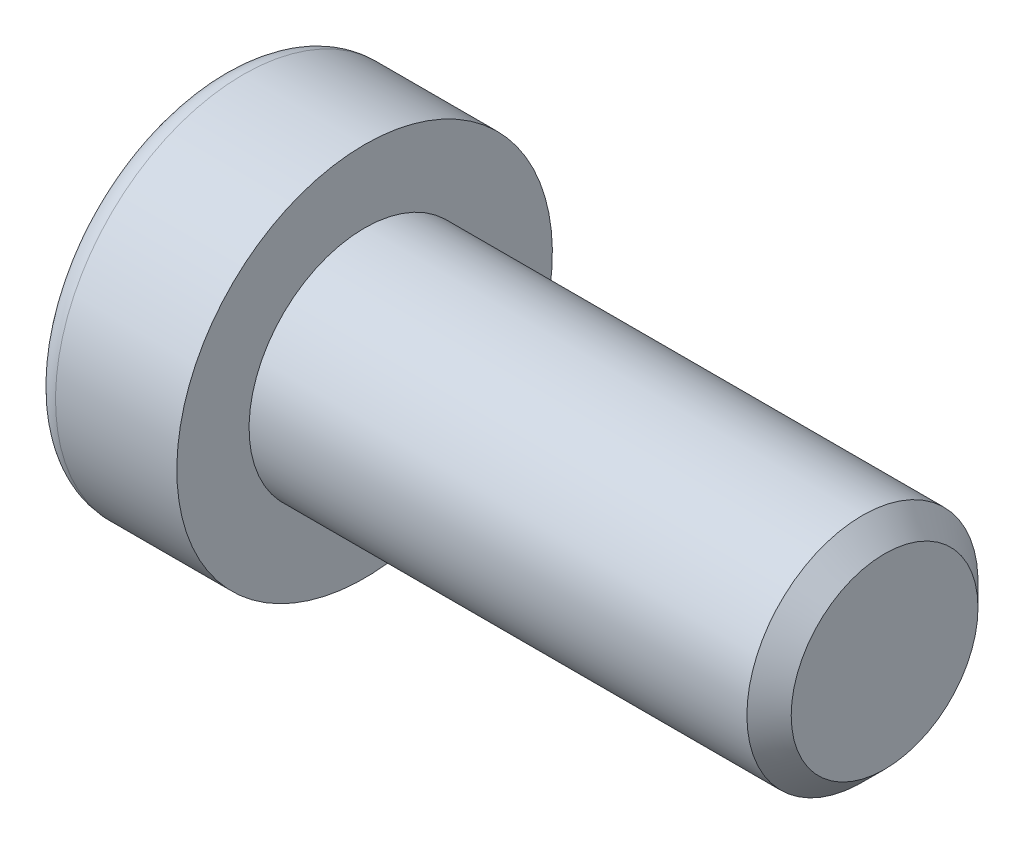
ISO-10303-21;
HEADER;
FILE_DESCRIPTION(('STEP AP214'),'2;1');
FILE_NAME('part.step','',(''),(''),'','','');
FILE_SCHEMA(('AUTOMOTIVE_DESIGN { 1 0 10303 214 1 1 1 1 }'));
ENDSEC;
DATA;
#1=APPLICATION_CONTEXT('core data for automotive mechanical design processes');
#2=APPLICATION_PROTOCOL_DEFINITION('international standard','automotive_design',2000,#1);
#3=PRODUCT_CONTEXT('',#1,'mechanical');
#4=PRODUCT('Part','Part','',(#3));
#5=PRODUCT_RELATED_PRODUCT_CATEGORY('part','',(#4));
#6=PRODUCT_DEFINITION_FORMATION('','',#4);
#7=PRODUCT_DEFINITION_CONTEXT('part definition',#1,'design');
#8=PRODUCT_DEFINITION('design','',#6,#7);
#9=PRODUCT_DEFINITION_SHAPE('','',#8);
#10=(LENGTH_UNIT() NAMED_UNIT(*) SI_UNIT(.MILLI.,.METRE.));
#11=(NAMED_UNIT(*) PLANE_ANGLE_UNIT() SI_UNIT($,.RADIAN.));
#12=(NAMED_UNIT(*) SI_UNIT($,.STERADIAN.) SOLID_ANGLE_UNIT());
#13=UNCERTAINTY_MEASURE_WITH_UNIT(LENGTH_MEASURE(1.E-05),#10,'distance_accuracy_value','');
#14=(GEOMETRIC_REPRESENTATION_CONTEXT(3) GLOBAL_UNCERTAINTY_ASSIGNED_CONTEXT((#13)) GLOBAL_UNIT_ASSIGNED_CONTEXT((#10,
#11,#12)) REPRESENTATION_CONTEXT('',''));
#15=CARTESIAN_POINT('',(0.,0.,0.));
#16=DIRECTION('',(0.,0.,1.));
#17=DIRECTION('',(1.,0.,0.));
#18=AXIS2_PLACEMENT_3D('',#15,#16,#17);
#19=CARTESIAN_POINT('',(-1.21000000177673,0.,0.));
#20=DIRECTION('',(-1.,0.,0.));
#21=DIRECTION('',(0.,0.,1.));
#22=AXIS2_PLACEMENT_3D('',#19,#20,#21);
#23=CONICAL_SURFACE('',#22,2.9040718530382,1.04719754996794);
#24=CARTESIAN_POINT('',(0.466666669012739,-1.13686837721616E-10,0.));
#25=VERTEX_POINT('',#24);
#26=VERTEX_LOOP('',#25);
#27=FACE_BOUND('',#26,.T.);
#28=CARTESIAN_POINT('',(-1.20000000188032,2.50000000042828,1.44337567243126));
#29=CARTESIAN_POINT('',(-1.16336943336427,2.50000000015382,1.31652043353318));
#30=CARTESIAN_POINT('',(-1.13005584831707,2.50000000004123,1.18857018203745));
#31=CARTESIAN_POINT('',(-1.07190798610144,2.49999999995868,0.930454306037677));
#32=CARTESIAN_POINT('',(-1.04709427719735,2.49999999998906,0.800284096806924));
#33=CARTESIAN_POINT('',(-1.00846995036617,2.50000000001067,0.541556812494233));
#34=CARTESIAN_POINT('',(-0.994402236162447,2.50000000000284,0.413039534770439));
#35=CARTESIAN_POINT('',(-0.977611461824864,2.49999999999716,0.155400578562858));
#36=CARTESIAN_POINT('',(-0.974874494142074,2.49999999999929,0.02627983588409));
#37=CARTESIAN_POINT('',(-0.980582864422355,2.50000000000062,-0.21496841995549));
#38=CARTESIAN_POINT('',(-0.987626608278002,2.50000000000017,-0.327132134383147));
#39=CARTESIAN_POINT('',(-1.00994662771906,2.49999999999983,-0.550728853222557));
#40=CARTESIAN_POINT('',(-1.02523052031715,2.49999999999995,-0.66216108485018));
#41=CARTESIAN_POINT('',(-1.06343729360609,2.50000000000005,-0.886218434015897));
#42=CARTESIAN_POINT('',(-1.08652205474861,2.50000000000003,-0.998815208377871));
#43=CARTESIAN_POINT('',(-1.13891470311393,2.49999999999998,-1.2223298619213));
#44=CARTESIAN_POINT('',(-1.16821028805135,2.49999999999995,-1.33325060237494));
#45=CARTESIAN_POINT('',(-1.20000000215881,2.5,-1.44337567242466));
#46=B_SPLINE_CURVE_WITH_KNOTS('',3,(#28,#29,#30,#31,#32,#33,#34,#35,#36,#37,#38,#39,#40,#41,#42,
#43,#44,#45),.UNSPECIFIED.,.F.,.F.,(4,2,2,2,2,2,2,2,4),(0.,0.396270014515872,0.793492271437725,
1.18088450788727,1.56780111135406,1.90463472821334,2.24178024186127,2.58640202744164,
2.93034746593166),.UNSPECIFIED.);
#47=CARTESIAN_POINT('',(-1.20000000213914,2.49999999973261,1.44337567281968));
#48=VERTEX_POINT('',#47);
#49=CARTESIAN_POINT('',(-1.20000000222827,2.5,-1.44337567266531));
#50=VERTEX_POINT('',#49);
#51=EDGE_CURVE('E19',#48,#50,#46,.T.);
#52=ORIENTED_EDGE('',*,*,#51,.T.);
#53=CARTESIAN_POINT('',(-1.20000000188032,2.49999999974406,-1.44337567361636));
#54=CARTESIAN_POINT('',(-1.16336943336427,2.39014014011794,-1.50680329282772));
#55=CARTESIAN_POINT('',(-1.13005584831707,2.27933197184574,-1.57077841847808));
#56=CARTESIAN_POINT('',(-1.07190798610144,2.05579706606859,-1.69983635640647));
#57=CARTESIAN_POINT('',(-1.04709427719735,1.94306635807401,-1.76492146104816));
#58=CARTESIAN_POINT('',(-1.00846995036617,1.71900195721787,-1.89428510322322));
#59=CARTESIAN_POINT('',(-0.994402236162447,1.60770272987993,-1.95854374207834));
#60=CARTESIAN_POINT('',(-0.977611461824864,1.38458084879682,-2.08736322017721));
#61=CARTESIAN_POINT('',(-0.974874494142074,1.27275900548255,-2.15192359151843));
#62=CARTESIAN_POINT('',(-0.980582864422354,1.06383188730746,-2.27254771943938));
#63=CARTESIAN_POINT('',(-0.987626608278001,0.966695261230055,-2.32862957665281));
#64=CARTESIAN_POINT('',(-1.00994662771905,0.773054822512112,-2.44042793607223));
#65=CARTESIAN_POINT('',(-1.02523052031715,0.676551679122258,-2.49614405188614));
#66=CARTESIAN_POINT('',(-1.06343729360609,0.482512322840196,-2.60817272646909));
#67=CARTESIAN_POINT('',(-1.08652205474861,0.385000655858529,-2.66447111365005));
#68=CARTESIAN_POINT('',(-1.13891470311393,0.191431287771819,-2.77622844042172));
#69=CARTESIAN_POINT('',(-1.16821028805135,0.09537110873237,-2.83168881064853));
#70=CARTESIAN_POINT('',(-1.20000000215881,4.75795596297873E-10,-2.88675134567343));
#71=B_SPLINE_CURVE_WITH_KNOTS('',3,(#53,#54,#55,#56,#57,#58,#59,#60,#61,#62,#63,#64,#65,#66,#67,
#68,#69,#70),.UNSPECIFIED.,.F.,.F.,(4,2,2,2,2,2,2,2,4),(0.,0.396270014515871,0.793492271437724,
1.18088450788727,1.56780111135406,1.90463472821334,2.24178024186127,2.58640202744164,
2.93034746593166),.UNSPECIFIED.);
#72=CARTESIAN_POINT('',(-1.20000000213914,0.,-2.88675134563937));
#73=VERTEX_POINT('',#72);
#74=EDGE_CURVE('E79',#50,#73,#71,.T.);
#75=ORIENTED_EDGE('',*,*,#74,.T.);
#76=CARTESIAN_POINT('',(-1.20000000188032,-6.84219601947254E-10,-2.88675134604762));
#77=CARTESIAN_POINT('',(-1.16336943336427,-0.109859860035873,-2.8233237263609));
#78=CARTESIAN_POINT('',(-1.13005584831707,-0.220668028195489,-2.75934860051552));
#79=CARTESIAN_POINT('',(-1.07190798610144,-0.444202933890087,-2.63029066244415));
#80=CARTESIAN_POINT('',(-1.04709427719735,-0.556933641915047,-2.56520555785509));
#81=CARTESIAN_POINT('',(-1.00846995036617,-0.780998042792801,-2.43584191571745));
#82=CARTESIAN_POINT('',(-0.994402236162447,-0.892297270122914,-2.37158327684878));
#83=CARTESIAN_POINT('',(-0.977611461824864,-1.11541915120034,-2.24276379874007));
#84=CARTESIAN_POINT('',(-0.974874494142074,-1.22724099451673,-2.17820342740253));
#85=CARTESIAN_POINT('',(-0.980582864422354,-1.43616811269316,-2.05757929948389));
#86=CARTESIAN_POINT('',(-0.987626608278001,-1.53330473877011,-2.00149744226967));
#87=CARTESIAN_POINT('',(-1.00994662771906,-1.72694517748772,-1.88969908284967));
#88=CARTESIAN_POINT('',(-1.02523052031715,-1.82344832087769,-1.83398296703597));
#89=CARTESIAN_POINT('',(-1.06343729360609,-2.01748767715985,-1.72195429245319));
#90=CARTESIAN_POINT('',(-1.08652205474861,-2.1149993441415,-1.66565590527218));
#91=CARTESIAN_POINT('',(-1.13891470311393,-2.30856871222816,-1.55389857850043));
#92=CARTESIAN_POINT('',(-1.16821028805135,-2.40462889126758,-1.49843820827358));
#93=CARTESIAN_POINT('',(-1.20000000215881,-2.49999999952421,-1.44337567324877));
#94=B_SPLINE_CURVE_WITH_KNOTS('',3,(#76,#77,#78,#79,#80,#81,#82,#83,#84,#85,#86,#87,#88,#89,#90,
#91,#92,#93),.UNSPECIFIED.,.F.,.F.,(4,2,2,2,2,2,2,2,4),(0.,0.396270014515872,0.793492271437725,
1.18088450788727,1.56780111135406,1.90463472821334,2.24178024186127,2.58640202744164,
2.93034746593167),.UNSPECIFIED.);
#95=CARTESIAN_POINT('',(-1.20000000213914,-2.49999999973261,-1.44337567281968));
#96=VERTEX_POINT('',#95);
#97=EDGE_CURVE('E104',#73,#96,#94,.T.);
#98=ORIENTED_EDGE('',*,*,#97,.T.);
#99=CARTESIAN_POINT('',(-1.20000000188032,-2.50000000042828,-1.44337567243126));
#100=CARTESIAN_POINT('',(-1.16336943336427,-2.50000000015382,-1.31652043353318));
#101=CARTESIAN_POINT('',(-1.13005584831707,-2.50000000004123,-1.18857018203745));
#102=CARTESIAN_POINT('',(-1.07190798610144,-2.49999999995868,-0.93045430603768));
#103=CARTESIAN_POINT('',(-1.04709427719735,-2.49999999998906,-0.800284096806928));
#104=CARTESIAN_POINT('',(-1.00846995036617,-2.50000000001067,-0.541556812494236));
#105=CARTESIAN_POINT('',(-0.994402236162447,-2.50000000000284,-0.413039534770443));
#106=CARTESIAN_POINT('',(-0.977611461824863,-2.49999999999716,-0.155400578562862));
#107=CARTESIAN_POINT('',(-0.974874494142073,-2.49999999999929,-0.0262798358840941));
#108=CARTESIAN_POINT('',(-0.980582864422354,-2.50000000000062,0.214968419955486));
#109=CARTESIAN_POINT('',(-0.987626608278001,-2.50000000000017,0.327132134383144));
#110=CARTESIAN_POINT('',(-1.00994662771905,-2.49999999999983,0.550728853222554));
#111=CARTESIAN_POINT('',(-1.02523052031715,-2.49999999999995,0.662161084850177));
#112=CARTESIAN_POINT('',(-1.06343729360609,-2.50000000000005,0.886218434015895));
#113=CARTESIAN_POINT('',(-1.08652205474861,-2.50000000000002,0.99881520837787));
#114=CARTESIAN_POINT('',(-1.13891470311393,-2.49999999999998,1.2223298619213));
#115=CARTESIAN_POINT('',(-1.16821028805135,-2.49999999999995,1.33325060237494));
#116=CARTESIAN_POINT('',(-1.20000000215881,-2.5,1.44337567242466));
#117=B_SPLINE_CURVE_WITH_KNOTS('',3,(#99,#100,#101,#102,#103,#104,#105,#106,#107,#108,#109,#110,
#111,#112,#113,#114,#115,#116),.UNSPECIFIED.,.F.,.F.,(4,2,2,2,2,2,2,2,4),(0.,0.396270014515872,
0.793492271437724,1.18088450788727,1.56780111135406,1.90463472821334,2.24178024186127,
2.58640202744164,2.93034746593167),.UNSPECIFIED.);
#118=CARTESIAN_POINT('',(-1.20000000213914,-2.49999999973261,1.44337567281969));
#119=VERTEX_POINT('',#118);
#120=EDGE_CURVE('E128',#96,#119,#117,.T.);
#121=ORIENTED_EDGE('',*,*,#120,.T.);
#122=CARTESIAN_POINT('',(-1.20000000188032,-2.49999999974406,1.44337567361636));
#123=CARTESIAN_POINT('',(-1.16336943336427,-2.39014014011795,1.50680329282772));
#124=CARTESIAN_POINT('',(-1.13005584831707,-2.27933197184574,1.57077841847808));
#125=CARTESIAN_POINT('',(-1.07190798610144,-2.05579706606859,1.69983635640647));
#126=CARTESIAN_POINT('',(-1.04709427719735,-1.94306635807401,1.76492146104816));
#127=CARTESIAN_POINT('',(-1.00846995036617,-1.71900195721787,1.89428510322322));
#128=CARTESIAN_POINT('',(-0.994402236162447,-1.60770272987993,1.95854374207834));
#129=CARTESIAN_POINT('',(-0.977611461824864,-1.38458084879682,2.08736322017721));
#130=CARTESIAN_POINT('',(-0.974874494142074,-1.27275900548255,2.15192359151843));
#131=CARTESIAN_POINT('',(-0.980582864422354,-1.06383188730746,2.27254771943938));
#132=CARTESIAN_POINT('',(-0.987626608278001,-0.966695261230056,2.32862957665281));
#133=CARTESIAN_POINT('',(-1.00994662771905,-0.773054822512113,2.44042793607223));
#134=CARTESIAN_POINT('',(-1.02523052031715,-0.676551679122259,2.49614405188614));
#135=CARTESIAN_POINT('',(-1.06343729360609,-0.482512322840196,2.60817272646909));
#136=CARTESIAN_POINT('',(-1.08652205474861,-0.385000655858529,2.66447111365005));
#137=CARTESIAN_POINT('',(-1.13891470311393,-0.19143128777182,2.77622844042172));
#138=CARTESIAN_POINT('',(-1.16821028805135,-0.0953711087323701,2.83168881064853));
#139=CARTESIAN_POINT('',(-1.20000000215881,-4.7579556411033E-10,2.88675134567343));
#140=B_SPLINE_CURVE_WITH_KNOTS('',3,(#122,#123,#124,#125,#126,#127,#128,#129,#130,#131,#132,
#133,#134,#135,#136,#137,#138,#139),.UNSPECIFIED.,.F.,.F.,(4,2,2,2,2,2,2,2,4),(0.,
0.396270014515872,0.793492271437725,1.18088450788727,1.56780111135406,1.90463472821334,
2.24178024186127,2.58640202744164,2.93034746593167),.UNSPECIFIED.);
#141=CARTESIAN_POINT('',(-1.20000000213914,0.,2.88675134563937));
#142=VERTEX_POINT('',#141);
#143=EDGE_CURVE('E136',#119,#142,#140,.T.);
#144=ORIENTED_EDGE('',*,*,#143,.T.);
#145=CARTESIAN_POINT('',(-1.20000000188032,6.84218409592331E-10,2.88675134604763));
#146=CARTESIAN_POINT('',(-1.16336943336427,0.109859860035872,2.8233237263609));
#147=CARTESIAN_POINT('',(-1.13005584831707,0.220668028195487,2.75934860051552));
#148=CARTESIAN_POINT('',(-1.07190798610144,0.444202933890086,2.63029066244415));
#149=CARTESIAN_POINT('',(-1.04709427719735,0.556933641915045,2.56520555785509));
#150=CARTESIAN_POINT('',(-1.00846995036617,0.780998042792799,2.43584191571745));
#151=CARTESIAN_POINT('',(-0.994402236162446,0.892297270122912,2.37158327684878));
#152=CARTESIAN_POINT('',(-0.977611461824863,1.11541915120034,2.24276379874007));
#153=CARTESIAN_POINT('',(-0.974874494142073,1.22724099451673,2.17820342740253));
#154=CARTESIAN_POINT('',(-0.980582864422353,1.43616811269316,2.05757929948389));
#155=CARTESIAN_POINT('',(-0.987626608278,1.53330473877011,2.00149744226967));
#156=CARTESIAN_POINT('',(-1.00994662771905,1.72694517748772,1.88969908284967));
#157=CARTESIAN_POINT('',(-1.02523052031715,1.82344832087769,1.83398296703596));
#158=CARTESIAN_POINT('',(-1.06343729360609,2.01748767715985,1.72195429245319));
#159=CARTESIAN_POINT('',(-1.08652205474861,2.1149993441415,1.66565590527218));
#160=CARTESIAN_POINT('',(-1.13891470311393,2.30856871222816,1.55389857850042));
#161=CARTESIAN_POINT('',(-1.16821028805135,2.40462889126758,1.49843820827358));
#162=CARTESIAN_POINT('',(-1.2000000021588,2.49999999952421,1.44337567324876));
#163=B_SPLINE_CURVE_WITH_KNOTS('',3,(#145,#146,#147,#148,#149,#150,#151,#152,#153,#154,#155,
#156,#157,#158,#159,#160,#161,#162),.UNSPECIFIED.,.F.,.F.,(4,2,2,2,2,2,2,2,4),(0.,
0.396270014515872,0.793492271437725,1.18088450788727,1.56780111135406,1.90463472821334,
2.24178024186127,2.58640202744164,2.93034746593167),.UNSPECIFIED.);
#164=EDGE_CURVE('E81',#142,#48,#163,.T.);
#165=ORIENTED_EDGE('',*,*,#164,.T.);
#166=EDGE_LOOP('',(#52,#75,#98,#121,#144,#165));
#167=FACE_BOUND('',#166,.T.);
#168=ADVANCED_FACE('F15',(#27,#167),#23,.F.);
#169=CARTESIAN_POINT('',(-5.,2.5,1.44337567297406));
#170=DIRECTION('',(0.,1.,0.));
#171=DIRECTION('',(0.,0.,1.));
#172=AXIS2_PLACEMENT_3D('',#169,#170,#171);
#173=PLANE('',#172);
#174=DIRECTION('',(1.,0.,0.));
#175=VECTOR('',#174,1.);
#176=CARTESIAN_POINT('',(-5.,2.5,1.44337567297406));
#177=LINE('',#176,#175);
#178=CARTESIAN_POINT('',(-5.,2.5,1.44337567297406));
#179=VERTEX_POINT('',#178);
#180=EDGE_CURVE('E83',#48,#179,#177,.F.);
#181=ORIENTED_EDGE('',*,*,#180,.T.);
#182=DIRECTION('',(0.,0.,1.));
#183=VECTOR('',#182,1.);
#184=CARTESIAN_POINT('',(-5.,2.5,0.));
#185=LINE('',#184,#183);
#186=CARTESIAN_POINT('',(-5.,2.5,-1.44337567297407));
#187=VERTEX_POINT('',#186);
#188=EDGE_CURVE('E88',#187,#179,#185,.T.);
#189=ORIENTED_EDGE('',*,*,#188,.F.);
#190=DIRECTION('',(1.,0.,0.));
#191=VECTOR('',#190,1.);
#192=CARTESIAN_POINT('',(-5.,2.5,-1.44337567297407));
#193=LINE('',#192,#191);
#194=EDGE_CURVE('E86',#187,#50,#193,.T.);
#195=ORIENTED_EDGE('',*,*,#194,.T.);
#196=ORIENTED_EDGE('',*,*,#51,.F.);
#197=EDGE_LOOP('',(#181,#189,#195,#196));
#198=FACE_BOUND('',#197,.T.);
#199=ADVANCED_FACE('F75',(#198),#173,.F.);
#200=CARTESIAN_POINT('',(-5.,0.,2.88675134594813));
#201=DIRECTION('',(0.,0.500000000000001,0.866025403784438));
#202=DIRECTION('',(0.,-0.866025403784438,0.500000000000001));
#203=AXIS2_PLACEMENT_3D('',#200,#201,#202);
#204=PLANE('',#203);
#205=DIRECTION('',(1.,0.,0.));
#206=VECTOR('',#205,1.);
#207=CARTESIAN_POINT('',(-5.,0.,2.88675134594813));
#208=LINE('',#207,#206);
#209=CARTESIAN_POINT('',(-5.,0.,2.88675134594813));
#210=VERTEX_POINT('',#209);
#211=EDGE_CURVE('E140',#142,#210,#208,.F.);
#212=ORIENTED_EDGE('',*,*,#211,.T.);
#213=DIRECTION('',(0.,-0.866025403784438,0.500000000000001));
#214=VECTOR('',#213,1.);
#215=CARTESIAN_POINT('',(-5.,2.5,1.44337567297406));
#216=LINE('',#215,#214);
#217=EDGE_CURVE('E94',#179,#210,#216,.T.);
#218=ORIENTED_EDGE('',*,*,#217,.F.);
#219=ORIENTED_EDGE('',*,*,#180,.F.);
#220=ORIENTED_EDGE('',*,*,#164,.F.);
#221=EDGE_LOOP('',(#212,#218,#219,#220));
#222=FACE_BOUND('',#221,.T.);
#223=ADVANCED_FACE('F144',(#222),#204,.F.);
#224=CARTESIAN_POINT('',(-5.,-2.5,1.44337567297406));
#225=DIRECTION('',(0.,-0.5,0.866025403784439));
#226=DIRECTION('',(0.,-0.866025403784439,-0.5));
#227=AXIS2_PLACEMENT_3D('',#224,#225,#226);
#228=PLANE('',#227);
#229=DIRECTION('',(1.,0.,0.));
#230=VECTOR('',#229,1.);
#231=CARTESIAN_POINT('',(-5.,-2.5,1.44337567297406));
#232=LINE('',#231,#230);
#233=CARTESIAN_POINT('',(-5.,-2.5,1.44337567297406));
#234=VERTEX_POINT('',#233);
#235=EDGE_CURVE('E135',#119,#234,#232,.F.);
#236=ORIENTED_EDGE('',*,*,#235,.T.);
#237=DIRECTION('',(0.,-0.866025403784439,-0.5));
#238=VECTOR('',#237,1.);
#239=CARTESIAN_POINT('',(-5.,0.,2.88675134594813));
#240=LINE('',#239,#238);
#241=EDGE_CURVE('E222',#210,#234,#240,.T.);
#242=ORIENTED_EDGE('',*,*,#241,.F.);
#243=ORIENTED_EDGE('',*,*,#211,.F.);
#244=ORIENTED_EDGE('',*,*,#143,.F.);
#245=EDGE_LOOP('',(#236,#242,#243,#244));
#246=FACE_BOUND('',#245,.T.);
#247=ADVANCED_FACE('F124',(#246),#228,.F.);
#248=CARTESIAN_POINT('',(-5.,-2.5,-1.44337567297406));
#249=DIRECTION('',(0.,-1.,0.));
#250=DIRECTION('',(0.,0.,-1.));
#251=AXIS2_PLACEMENT_3D('',#248,#249,#250);
#252=PLANE('',#251);
#253=DIRECTION('',(1.,0.,0.));
#254=VECTOR('',#253,1.);
#255=CARTESIAN_POINT('',(-5.,-2.5,-1.44337567297406));
#256=LINE('',#255,#254);
#257=CARTESIAN_POINT('',(-5.,-2.5,-1.44337567297406));
#258=VERTEX_POINT('',#257);
#259=EDGE_CURVE('E134',#96,#258,#256,.F.);
#260=ORIENTED_EDGE('',*,*,#259,.T.);
#261=DIRECTION('',(0.,0.,1.));
#262=VECTOR('',#261,1.);
#263=CARTESIAN_POINT('',(-5.,-2.5,0.));
#264=LINE('',#263,#262);
#265=EDGE_CURVE('E219',#234,#258,#264,.F.);
#266=ORIENTED_EDGE('',*,*,#265,.F.);
#267=ORIENTED_EDGE('',*,*,#235,.F.);
#268=ORIENTED_EDGE('',*,*,#120,.F.);
#269=EDGE_LOOP('',(#260,#266,#267,#268));
#270=FACE_BOUND('',#269,.T.);
#271=ADVANCED_FACE('F120',(#270),#252,.F.);
#272=CARTESIAN_POINT('',(-5.,0.,-2.88675134594813));
#273=DIRECTION('',(0.,-0.5,-0.866025403784439));
#274=DIRECTION('',(0.,0.866025403784439,-0.5));
#275=AXIS2_PLACEMENT_3D('',#272,#273,#274);
#276=PLANE('',#275);
#277=DIRECTION('',(1.,0.,0.));
#278=VECTOR('',#277,1.);
#279=CARTESIAN_POINT('',(-5.,0.,-2.88675134594813));
#280=LINE('',#279,#278);
#281=CARTESIAN_POINT('',(-5.,0.,-2.88675134594813));
#282=VERTEX_POINT('',#281);
#283=EDGE_CURVE('E37',#73,#282,#280,.F.);
#284=ORIENTED_EDGE('',*,*,#283,.T.);
#285=DIRECTION('',(0.,0.866025403784438,-0.500000000000001));
#286=VECTOR('',#285,1.);
#287=CARTESIAN_POINT('',(-5.,-2.5,-1.44337567297406));
#288=LINE('',#287,#286);
#289=EDGE_CURVE('E216',#258,#282,#288,.T.);
#290=ORIENTED_EDGE('',*,*,#289,.F.);
#291=ORIENTED_EDGE('',*,*,#259,.F.);
#292=ORIENTED_EDGE('',*,*,#97,.F.);
#293=EDGE_LOOP('',(#284,#290,#291,#292));
#294=FACE_BOUND('',#293,.T.);
#295=ADVANCED_FACE('F114',(#294),#276,.F.);
#296=CARTESIAN_POINT('',(-5.,2.5,-1.44337567297407));
#297=DIRECTION('',(0.,0.5,-0.866025403784439));
#298=DIRECTION('',(0.,0.866025403784439,0.5));
#299=AXIS2_PLACEMENT_3D('',#296,#297,#298);
#300=PLANE('',#299);
#301=ORIENTED_EDGE('',*,*,#194,.F.);
#302=DIRECTION('',(0.,0.866025403784439,0.5));
#303=VECTOR('',#302,1.);
#304=CARTESIAN_POINT('',(-5.,0.,-2.88675134594813));
#305=LINE('',#304,#303);
#306=EDGE_CURVE('E214',#282,#187,#305,.T.);
#307=ORIENTED_EDGE('',*,*,#306,.F.);
#308=ORIENTED_EDGE('',*,*,#283,.F.);
#309=ORIENTED_EDGE('',*,*,#74,.F.);
#310=EDGE_LOOP('',(#301,#307,#308,#309));
#311=FACE_BOUND('',#310,.T.);
#312=ADVANCED_FACE('F92',(#311),#300,.F.);
#313=CARTESIAN_POINT('',(-5.,4.69337567297407,0.));
#314=DIRECTION('',(-1.,0.,0.));
#315=DIRECTION('',(0.,0.,1.));
#316=AXIS2_PLACEMENT_3D('',#313,#314,#315);
#317=PLANE('',#316);
#318=ORIENTED_EDGE('',*,*,#289,.T.);
#319=ORIENTED_EDGE('',*,*,#306,.T.);
#320=ORIENTED_EDGE('',*,*,#188,.T.);
#321=ORIENTED_EDGE('',*,*,#217,.T.);
#322=ORIENTED_EDGE('',*,*,#241,.T.);
#323=ORIENTED_EDGE('',*,*,#265,.T.);
#324=EDGE_LOOP('',(#318,#319,#320,#321,#322,#323));
#325=FACE_BOUND('',#324,.T.);
#326=CARTESIAN_POINT('',(-5.,0.,0.));
#327=DIRECTION('',(1.,0.,0.));
#328=DIRECTION('',(0.,1.,0.));
#329=AXIS2_PLACEMENT_3D('',#326,#327,#328);
#330=CIRCLE('',#329,5.7);
#331=CARTESIAN_POINT('',(-5.,5.7,0.));
#332=VERTEX_POINT('',#331);
#333=EDGE_CURVE('E191',#332,#332,#330,.T.);
#334=ORIENTED_EDGE('',*,*,#333,.F.);
#335=EDGE_LOOP('',(#334));
#336=FACE_BOUND('',#335,.T.);
#337=ADVANCED_FACE('F113',(#325,#336),#317,.T.);
#338=CARTESIAN_POINT('',(-4.2,0.,0.));
#339=DIRECTION('',(1.,0.,0.));
#340=DIRECTION('',(0.,0.,-1.));
#341=AXIS2_PLACEMENT_3D('',#338,#339,#340);
#342=TOROIDAL_SURFACE('',#341,5.7,0.8);
#343=CARTESIAN_POINT('',(-4.2,0.,0.));
#344=DIRECTION('',(1.,0.,0.));
#345=DIRECTION('',(0.,1.,0.));
#346=AXIS2_PLACEMENT_3D('',#343,#344,#345);
#347=CIRCLE('',#346,6.5);
#348=CARTESIAN_POINT('',(-4.2,6.5,0.));
#349=VERTEX_POINT('',#348);
#350=EDGE_CURVE('E232',#349,#349,#347,.T.);
#351=ORIENTED_EDGE('',*,*,#350,.F.);
#352=EDGE_LOOP('',(#351));
#353=FACE_BOUND('',#352,.T.);
#354=ORIENTED_EDGE('',*,*,#333,.T.);
#355=EDGE_LOOP('',(#354));
#356=FACE_BOUND('',#355,.T.);
#357=ADVANCED_FACE('F175',(#353,#356),#342,.T.);
#358=CARTESIAN_POINT('',(-2.5,0.,0.));
#359=DIRECTION('',(1.,0.,0.));
#360=DIRECTION('',(0.,1.,0.));
#361=AXIS2_PLACEMENT_3D('',#358,#359,#360);
#362=CYLINDRICAL_SURFACE('',#361,6.5);
#363=ORIENTED_EDGE('',*,*,#350,.T.);
#364=EDGE_LOOP('',(#363));
#365=FACE_BOUND('',#364,.T.);
#366=CARTESIAN_POINT('',(0.,0.,0.));
#367=DIRECTION('',(1.,0.,0.));
#368=DIRECTION('',(0.,1.,0.));
#369=AXIS2_PLACEMENT_3D('',#366,#367,#368);
#370=CIRCLE('',#369,6.5);
#371=CARTESIAN_POINT('',(0.,6.5,0.));
#372=VERTEX_POINT('',#371);
#373=EDGE_CURVE('E102',#372,#372,#370,.T.);
#374=ORIENTED_EDGE('',*,*,#373,.F.);
#375=EDGE_LOOP('',(#374));
#376=FACE_BOUND('',#375,.T.);
#377=ADVANCED_FACE('F172',(#365,#376),#362,.T.);
#378=CARTESIAN_POINT('',(18.,2.,0.));
#379=DIRECTION('',(1.,0.,0.));
#380=DIRECTION('',(0.,0.,-1.));
#381=AXIS2_PLACEMENT_3D('',#378,#379,#380);
#382=PLANE('',#381);
#383=CARTESIAN_POINT('',(18.0000000003133,0.,0.));
#384=DIRECTION('',(-1.,0.,0.));
#385=DIRECTION('',(0.,0.,1.));
#386=AXIS2_PLACEMENT_3D('',#383,#384,#385);
#387=CIRCLE('',#386,3.23318750042745);
#388=CARTESIAN_POINT('',(18.0000000003133,0.,3.23318750042745));
#389=VERTEX_POINT('',#388);
#390=EDGE_CURVE('E228',#389,#389,#387,.T.);
#391=ORIENTED_EDGE('',*,*,#390,.F.);
#392=EDGE_LOOP('',(#391));
#393=FACE_BOUND('',#392,.T.);
#394=ADVANCED_FACE('F168',(#393),#382,.T.);
#395=CARTESIAN_POINT('',(0.,5.25,0.));
#396=DIRECTION('',(1.,0.,0.));
#397=DIRECTION('',(0.,0.,-1.));
#398=AXIS2_PLACEMENT_3D('',#395,#396,#397);
#399=PLANE('',#398);
#400=CARTESIAN_POINT('',(0.,0.,0.));
#401=DIRECTION('',(1.,0.,0.));
#402=DIRECTION('',(0.,1.,0.));
#403=AXIS2_PLACEMENT_3D('',#400,#401,#402);
#404=CIRCLE('',#403,4.);
#405=CARTESIAN_POINT('',(0.,4.,0.));
#406=VERTEX_POINT('',#405);
#407=EDGE_CURVE('E28',#406,#406,#404,.T.);
#408=ORIENTED_EDGE('',*,*,#407,.F.);
#409=EDGE_LOOP('',(#408));
#410=FACE_BOUND('',#409,.T.);
#411=ORIENTED_EDGE('',*,*,#373,.T.);
#412=EDGE_LOOP('',(#411));
#413=FACE_BOUND('',#412,.T.);
#414=ADVANCED_FACE('F161',(#410,#413),#399,.T.);
#415=CARTESIAN_POINT('',(17.2331874997553,0.,0.));
#416=DIRECTION('',(-1.,0.,0.));
#417=DIRECTION('',(0.,0.,1.));
#418=AXIS2_PLACEMENT_3D('',#415,#416,#417);
#419=CONICAL_SURFACE('',#418,3.99999999956435,0.78539816247083);
#420=ORIENTED_EDGE('',*,*,#390,.T.);
#421=EDGE_LOOP('',(#420));
#422=FACE_BOUND('',#421,.T.);
#423=CARTESIAN_POINT('',(17.2331875,0.,0.));
#424=DIRECTION('',(1.,0.,0.));
#425=DIRECTION('',(0.,1.,0.));
#426=AXIS2_PLACEMENT_3D('',#423,#424,#425);
#427=CIRCLE('',#426,4.);
#428=CARTESIAN_POINT('',(17.2331875,4.,0.));
#429=VERTEX_POINT('',#428);
#430=EDGE_CURVE('E10',#429,#429,#427,.F.);
#431=ORIENTED_EDGE('',*,*,#430,.F.);
#432=EDGE_LOOP('',(#431));
#433=FACE_BOUND('',#432,.T.);
#434=ADVANCED_FACE('F155',(#422,#433),#419,.T.);
#435=CARTESIAN_POINT('',(9.5,0.,0.));
#436=DIRECTION('',(1.,0.,0.));
#437=DIRECTION('',(0.,1.,0.));
#438=AXIS2_PLACEMENT_3D('',#435,#436,#437);
#439=CYLINDRICAL_SURFACE('',#438,4.);
#440=ORIENTED_EDGE('',*,*,#430,.T.);
#441=EDGE_LOOP('',(#440));
#442=FACE_BOUND('',#441,.T.);
#443=ORIENTED_EDGE('',*,*,#407,.T.);
#444=EDGE_LOOP('',(#443));
#445=FACE_BOUND('',#444,.T.);
#446=ADVANCED_FACE('F153',(#442,#445),#439,.T.);
#447=CLOSED_SHELL('',(#168,#199,#223,#247,#271,#295,#312,#337,#357,#377,#394,#414,#434,#446));
#448=MANIFOLD_SOLID_BREP('B1',#447);
#449=ADVANCED_BREP_SHAPE_REPRESENTATION('',(#18,#448),#14);
#450=SHAPE_DEFINITION_REPRESENTATION(#9,#449);
ENDSEC;
END-ISO-10303-21;
